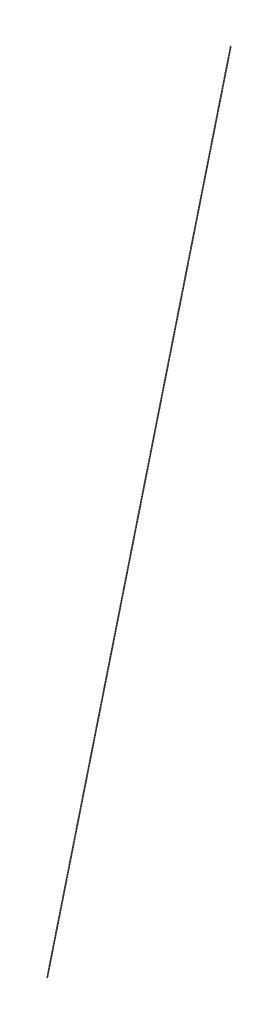
ISO-10303-21;
HEADER;
FILE_DESCRIPTION(('STEP AP214'),'2;1');
FILE_NAME('part.step','',(''),(''),'','','');
FILE_SCHEMA(('AUTOMOTIVE_DESIGN { 1 0 10303 214 1 1 1 1 }'));
ENDSEC;
DATA;
#1=APPLICATION_CONTEXT('core data for automotive mechanical design processes');
#2=APPLICATION_PROTOCOL_DEFINITION('international standard','automotive_design',2000,#1);
#3=PRODUCT_CONTEXT('',#1,'mechanical');
#4=PRODUCT('Part','Part','',(#3));
#5=PRODUCT_RELATED_PRODUCT_CATEGORY('part','',(#4));
#6=PRODUCT_DEFINITION_FORMATION('','',#4);
#7=PRODUCT_DEFINITION_CONTEXT('part definition',#1,'design');
#8=PRODUCT_DEFINITION('design','',#6,#7);
#9=PRODUCT_DEFINITION_SHAPE('','',#8);
#10=(LENGTH_UNIT() NAMED_UNIT(*) SI_UNIT(.MILLI.,.METRE.));
#11=(NAMED_UNIT(*) PLANE_ANGLE_UNIT() SI_UNIT($,.RADIAN.));
#12=(NAMED_UNIT(*) SI_UNIT($,.STERADIAN.) SOLID_ANGLE_UNIT());
#13=UNCERTAINTY_MEASURE_WITH_UNIT(LENGTH_MEASURE(1.E-05),#10,'distance_accuracy_value','');
#14=(GEOMETRIC_REPRESENTATION_CONTEXT(3) GLOBAL_UNCERTAINTY_ASSIGNED_CONTEXT((#13)) GLOBAL_UNIT_ASSIGNED_CONTEXT((#10,
#11,#12)) REPRESENTATION_CONTEXT('',''));
#15=CARTESIAN_POINT('',(0.,0.,0.));
#16=DIRECTION('',(0.,0.,1.));
#17=DIRECTION('',(1.,0.,0.));
#18=AXIS2_PLACEMENT_3D('',#15,#16,#17);
#19=CARTESIAN_POINT('',(0.,0.,0.));
#20=DIRECTION('',(0.20018321131915,0.979758481415677,0.));
#21=DIRECTION('',(-0.979758481415677,0.20018321131915,0.));
#22=AXIS2_PLACEMENT_3D('',#19,#20,#21);
#23=PLANE('',#22);
#24=CARTESIAN_POINT('',(0.,0.,0.));
#25=DIRECTION('',(0.20018321131915,0.979758481415677,0.));
#26=DIRECTION('',(-0.979758481415677,0.20018321131915,0.));
#27=AXIS2_PLACEMENT_3D('',#24,#25,#26);
#28=CIRCLE('',#27,0.5);
#29=CARTESIAN_POINT('',(-0.489879240707838,0.100091605659575,0.));
#30=VERTEX_POINT('',#29);
#31=EDGE_CURVE('E47',#30,#30,#28,.T.);
#32=ORIENTED_EDGE('',*,*,#31,.F.);
#33=EDGE_LOOP('',(#32));
#34=FACE_BOUND('',#33,.T.);
#35=ADVANCED_FACE('F41',(#34),#23,.F.);
#36=CARTESIAN_POINT('',(307.5,1505.,0.));
#37=DIRECTION('',(0.20018321131915,0.979758481415677,0.));
#38=DIRECTION('',(-0.979758481415677,0.20018321131915,0.));
#39=AXIS2_PLACEMENT_3D('',#36,#37,#38);
#40=PLANE('',#39);
#41=CARTESIAN_POINT('',(307.5,1505.,0.));
#42=DIRECTION('',(0.20018321131915,0.979758481415677,0.));
#43=DIRECTION('',(-0.979758481415677,0.20018321131915,0.));
#44=AXIS2_PLACEMENT_3D('',#41,#42,#43);
#45=CIRCLE('',#44,0.5);
#46=CARTESIAN_POINT('',(307.010120759292,1505.10009160566,0.));
#47=VERTEX_POINT('',#46);
#48=EDGE_CURVE('E11',#47,#47,#45,.T.);
#49=ORIENTED_EDGE('',*,*,#48,.T.);
#50=EDGE_LOOP('',(#49));
#51=FACE_BOUND('',#50,.T.);
#52=ADVANCED_FACE('F56',(#51),#40,.T.);
#53=CARTESIAN_POINT('',(0.,0.,0.));
#54=DIRECTION('',(0.20018321131915,0.979758481415677,0.));
#55=DIRECTION('',(-0.979758481415677,0.20018321131915,0.));
#56=AXIS2_PLACEMENT_3D('',#53,#54,#55);
#57=CYLINDRICAL_SURFACE('',#56,0.5);
#58=ORIENTED_EDGE('',*,*,#48,.F.);
#59=EDGE_LOOP('',(#58));
#60=FACE_BOUND('',#59,.T.);
#61=ORIENTED_EDGE('',*,*,#31,.T.);
#62=EDGE_LOOP('',(#61));
#63=FACE_BOUND('',#62,.T.);
#64=ADVANCED_FACE('F53',(#60,#63),#57,.T.);
#65=CLOSED_SHELL('',(#35,#52,#64));
#66=MANIFOLD_SOLID_BREP('B2',#65);
#67=ADVANCED_BREP_SHAPE_REPRESENTATION('',(#18,#66),#14);
#68=SHAPE_DEFINITION_REPRESENTATION(#9,#67);
ENDSEC;
END-ISO-10303-21;
